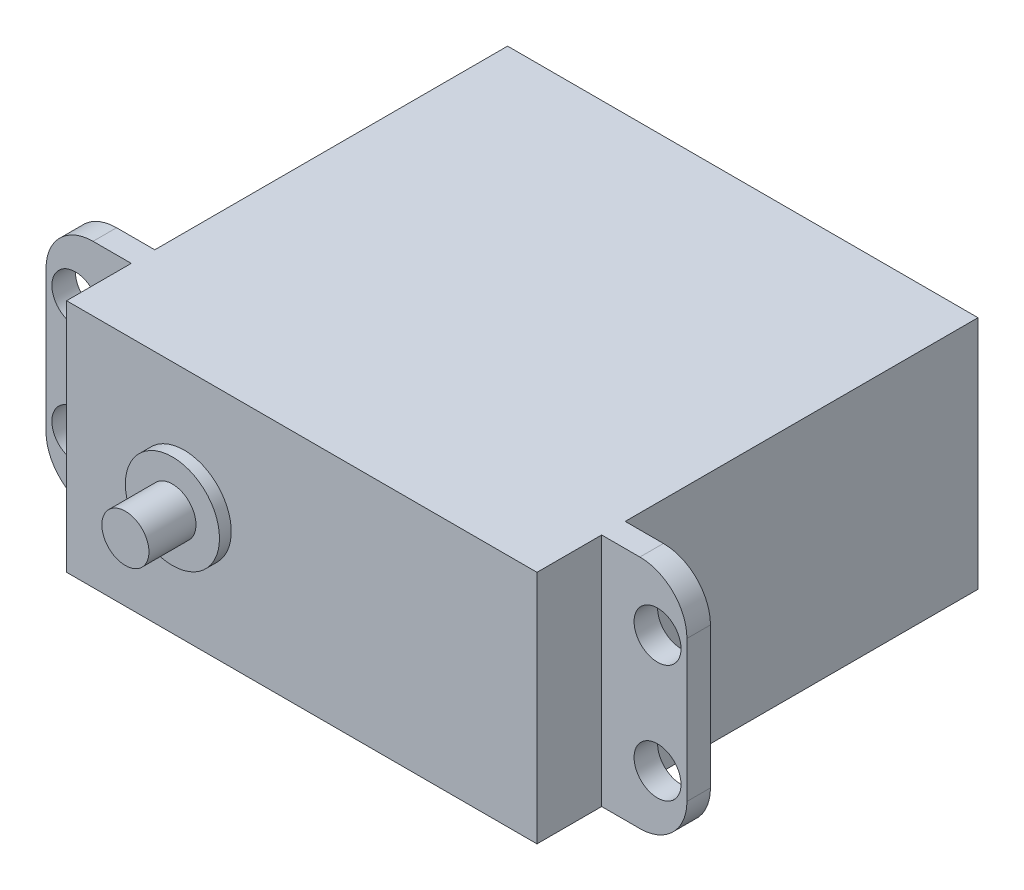
ISO-10303-21;
HEADER;
FILE_DESCRIPTION(('STEP AP214'),'2;1');
FILE_NAME('part.step','',(''),(''),'','','');
FILE_SCHEMA(('AUTOMOTIVE_DESIGN { 1 0 10303 214 1 1 1 1 }'));
ENDSEC;
DATA;
#1=APPLICATION_CONTEXT('core data for automotive mechanical design processes');
#2=APPLICATION_PROTOCOL_DEFINITION('international standard','automotive_design',2000,#1);
#3=PRODUCT_CONTEXT('',#1,'mechanical');
#4=PRODUCT('Part','Part','',(#3));
#5=PRODUCT_RELATED_PRODUCT_CATEGORY('part','',(#4));
#6=PRODUCT_DEFINITION_FORMATION('','',#4);
#7=PRODUCT_DEFINITION_CONTEXT('part definition',#1,'design');
#8=PRODUCT_DEFINITION('design','',#6,#7);
#9=PRODUCT_DEFINITION_SHAPE('','',#8);
#10=(LENGTH_UNIT() NAMED_UNIT(*) SI_UNIT(.MILLI.,.METRE.));
#11=(NAMED_UNIT(*) PLANE_ANGLE_UNIT() SI_UNIT($,.RADIAN.));
#12=(NAMED_UNIT(*) SI_UNIT($,.STERADIAN.) SOLID_ANGLE_UNIT());
#13=UNCERTAINTY_MEASURE_WITH_UNIT(LENGTH_MEASURE(1.E-05),#10,'distance_accuracy_value','');
#14=(GEOMETRIC_REPRESENTATION_CONTEXT(3) GLOBAL_UNCERTAINTY_ASSIGNED_CONTEXT((#13)) GLOBAL_UNIT_ASSIGNED_CONTEXT((#10,
#11,#12)) REPRESENTATION_CONTEXT('',''));
#15=CARTESIAN_POINT('',(0.,0.,0.));
#16=DIRECTION('',(0.,0.,1.));
#17=DIRECTION('',(1.,0.,0.));
#18=AXIS2_PLACEMENT_3D('',#15,#16,#17);
#19=CARTESIAN_POINT('',(-20.,-10.,37.5));
#20=DIRECTION('',(-1.,0.,0.));
#21=DIRECTION('',(0.,0.,1.));
#22=AXIS2_PLACEMENT_3D('',#19,#20,#21);
#23=PLANE('',#22);
#24=DIRECTION('',(0.,-1.,0.));
#25=VECTOR('',#24,1.);
#26=CARTESIAN_POINT('',(-20.,10.,30.));
#27=LINE('',#26,#25);
#28=CARTESIAN_POINT('',(-20.,10.,30.));
#29=VERTEX_POINT('',#28);
#30=CARTESIAN_POINT('',(-20.,-10.,30.));
#31=VERTEX_POINT('',#30);
#32=EDGE_CURVE('E190',#29,#31,#27,.T.);
#33=ORIENTED_EDGE('',*,*,#32,.F.);
#34=DIRECTION('',(0.,0.,-1.));
#35=VECTOR('',#34,1.);
#36=CARTESIAN_POINT('',(-20.,10.,37.5));
#37=LINE('',#36,#35);
#38=CARTESIAN_POINT('',(-20.,10.,0.));
#39=VERTEX_POINT('',#38);
#40=EDGE_CURVE('E185',#29,#39,#37,.T.);
#41=ORIENTED_EDGE('',*,*,#40,.T.);
#42=DIRECTION('',(0.,1.,0.));
#43=VECTOR('',#42,1.);
#44=CARTESIAN_POINT('',(-20.,-10.,0.));
#45=LINE('',#44,#43);
#46=CARTESIAN_POINT('',(-20.,-10.,0.));
#47=VERTEX_POINT('',#46);
#48=EDGE_CURVE('E248',#47,#39,#45,.T.);
#49=ORIENTED_EDGE('',*,*,#48,.F.);
#50=DIRECTION('',(0.,0.,-1.));
#51=VECTOR('',#50,1.);
#52=CARTESIAN_POINT('',(-20.,-10.,37.5));
#53=LINE('',#52,#51);
#54=EDGE_CURVE('E287',#31,#47,#53,.T.);
#55=ORIENTED_EDGE('',*,*,#54,.F.);
#56=EDGE_LOOP('',(#33,#41,#49,#55));
#57=FACE_BOUND('',#56,.T.);
#58=ADVANCED_FACE('F45',(#57),#23,.T.);
#59=CARTESIAN_POINT('',(20.,-10.,37.5));
#60=DIRECTION('',(-1.,0.,0.));
#61=DIRECTION('',(0.,0.,1.));
#62=AXIS2_PLACEMENT_3D('',#59,#60,#61);
#63=PLANE('',#62);
#64=DIRECTION('',(0.,0.,-1.));
#65=VECTOR('',#64,1.);
#66=CARTESIAN_POINT('',(20.,-10.,37.5));
#67=LINE('',#66,#65);
#68=CARTESIAN_POINT('',(20.,-10.,37.5));
#69=VERTEX_POINT('',#68);
#70=CARTESIAN_POINT('',(20.,-10.,32.));
#71=VERTEX_POINT('',#70);
#72=EDGE_CURVE('E288',#69,#71,#67,.T.);
#73=ORIENTED_EDGE('',*,*,#72,.T.);
#74=DIRECTION('',(0.,1.,0.));
#75=VECTOR('',#74,1.);
#76=CARTESIAN_POINT('',(20.,-10.,32.));
#77=LINE('',#76,#75);
#78=CARTESIAN_POINT('',(20.,10.,32.));
#79=VERTEX_POINT('',#78);
#80=EDGE_CURVE('E217',#71,#79,#77,.T.);
#81=ORIENTED_EDGE('',*,*,#80,.T.);
#82=DIRECTION('',(0.,0.,-1.));
#83=VECTOR('',#82,1.);
#84=CARTESIAN_POINT('',(20.,10.,37.5));
#85=LINE('',#84,#83);
#86=CARTESIAN_POINT('',(20.,10.,37.5));
#87=VERTEX_POINT('',#86);
#88=EDGE_CURVE('E293',#87,#79,#85,.T.);
#89=ORIENTED_EDGE('',*,*,#88,.F.);
#90=DIRECTION('',(0.,1.,0.));
#91=VECTOR('',#90,1.);
#92=CARTESIAN_POINT('',(20.,-10.,37.5));
#93=LINE('',#92,#91);
#94=EDGE_CURVE('E263',#69,#87,#93,.T.);
#95=ORIENTED_EDGE('',*,*,#94,.F.);
#96=EDGE_LOOP('',(#73,#81,#89,#95));
#97=FACE_BOUND('',#96,.T.);
#98=ADVANCED_FACE('F361',(#97),#63,.F.);
#99=DIRECTION('',(0.,1.,0.));
#100=VECTOR('',#99,1.);
#101=CARTESIAN_POINT('',(-20.,-10.,32.));
#102=LINE('',#101,#100);
#103=CARTESIAN_POINT('',(-20.,-10.,32.));
#104=VERTEX_POINT('',#103);
#105=CARTESIAN_POINT('',(-20.,10.,32.));
#106=VERTEX_POINT('',#105);
#107=EDGE_CURVE('E179',#104,#106,#102,.T.);
#108=ORIENTED_EDGE('',*,*,#107,.F.);
#109=CARTESIAN_POINT('',(-20.,-10.,37.5));
#110=VERTEX_POINT('',#109);
#111=EDGE_CURVE('E283',#110,#104,#53,.T.);
#112=ORIENTED_EDGE('',*,*,#111,.F.);
#113=DIRECTION('',(0.,1.,0.));
#114=VECTOR('',#113,1.);
#115=CARTESIAN_POINT('',(-20.,-10.,37.5));
#116=LINE('',#115,#114);
#117=CARTESIAN_POINT('',(-20.,10.,37.5));
#118=VERTEX_POINT('',#117);
#119=EDGE_CURVE('E182',#110,#118,#116,.T.);
#120=ORIENTED_EDGE('',*,*,#119,.T.);
#121=EDGE_CURVE('E164',#118,#106,#37,.T.);
#122=ORIENTED_EDGE('',*,*,#121,.T.);
#123=EDGE_LOOP('',(#108,#112,#120,#122));
#124=FACE_BOUND('',#123,.T.);
#125=ADVANCED_FACE('F178',(#124),#23,.T.);
#126=CARTESIAN_POINT('',(-20.,-10.,37.5));
#127=DIRECTION('',(0.,1.,0.));
#128=DIRECTION('',(0.,0.,1.));
#129=AXIS2_PLACEMENT_3D('',#126,#127,#128);
#130=PLANE('',#129);
#131=DIRECTION('',(1.,0.,0.));
#132=VECTOR('',#131,1.);
#133=CARTESIAN_POINT('',(-27.25,-10.,32.));
#134=LINE('',#133,#132);
#135=CARTESIAN_POINT('',(-23.25,-10.,32.));
#136=VERTEX_POINT('',#135);
#137=EDGE_CURVE('E172',#136,#104,#134,.T.);
#138=ORIENTED_EDGE('',*,*,#137,.F.);
#139=DIRECTION('',(0.,0.,1.));
#140=VECTOR('',#139,1.);
#141=CARTESIAN_POINT('',(-23.25,-10.,30.));
#142=LINE('',#141,#140);
#143=CARTESIAN_POINT('',(-23.25,-10.,30.));
#144=VERTEX_POINT('',#143);
#145=EDGE_CURVE('E70',#136,#144,#142,.F.);
#146=ORIENTED_EDGE('',*,*,#145,.T.);
#147=DIRECTION('',(1.,0.,0.));
#148=VECTOR('',#147,1.);
#149=CARTESIAN_POINT('',(-27.25,-10.,30.));
#150=LINE('',#149,#148);
#151=EDGE_CURVE('E205',#144,#31,#150,.T.);
#152=ORIENTED_EDGE('',*,*,#151,.T.);
#153=ORIENTED_EDGE('',*,*,#54,.T.);
#154=DIRECTION('',(1.,0.,0.));
#155=VECTOR('',#154,1.);
#156=CARTESIAN_POINT('',(-20.,-10.,0.));
#157=LINE('',#156,#155);
#158=CARTESIAN_POINT('',(20.,-10.,0.));
#159=VERTEX_POINT('',#158);
#160=EDGE_CURVE('E260',#47,#159,#157,.T.);
#161=ORIENTED_EDGE('',*,*,#160,.T.);
#162=CARTESIAN_POINT('',(20.,-10.,30.));
#163=VERTEX_POINT('',#162);
#164=EDGE_CURVE('E292',#163,#159,#67,.T.);
#165=ORIENTED_EDGE('',*,*,#164,.F.);
#166=DIRECTION('',(-1.,0.,0.));
#167=VECTOR('',#166,1.);
#168=CARTESIAN_POINT('',(27.25,-10.,30.));
#169=LINE('',#168,#167);
#170=CARTESIAN_POINT('',(23.25,-10.,30.));
#171=VERTEX_POINT('',#170);
#172=EDGE_CURVE('E245',#171,#163,#169,.T.);
#173=ORIENTED_EDGE('',*,*,#172,.F.);
#174=DIRECTION('',(0.,0.,1.));
#175=VECTOR('',#174,1.);
#176=CARTESIAN_POINT('',(23.25,-10.,37.5));
#177=LINE('',#176,#175);
#178=CARTESIAN_POINT('',(23.25,-10.,32.));
#179=VERTEX_POINT('',#178);
#180=EDGE_CURVE('E318',#171,#179,#177,.T.);
#181=ORIENTED_EDGE('',*,*,#180,.T.);
#182=DIRECTION('',(-1.,0.,0.));
#183=VECTOR('',#182,1.);
#184=CARTESIAN_POINT('',(27.25,-10.,32.));
#185=LINE('',#184,#183);
#186=EDGE_CURVE('E238',#179,#71,#185,.T.);
#187=ORIENTED_EDGE('',*,*,#186,.T.);
#188=ORIENTED_EDGE('',*,*,#72,.F.);
#189=DIRECTION('',(1.,0.,0.));
#190=VECTOR('',#189,1.);
#191=CARTESIAN_POINT('',(-20.,-10.,37.5));
#192=LINE('',#191,#190);
#193=EDGE_CURVE('E266',#110,#69,#192,.T.);
#194=ORIENTED_EDGE('',*,*,#193,.F.);
#195=ORIENTED_EDGE('',*,*,#111,.T.);
#196=EDGE_LOOP('',(#138,#146,#152,#153,#161,#165,#173,#181,#187,#188,#194,#195));
#197=FACE_BOUND('',#196,.T.);
#198=ADVANCED_FACE('F447',(#197),#130,.F.);
#199=CARTESIAN_POINT('',(20.,10.,30.));
#200=VERTEX_POINT('',#199);
#201=CARTESIAN_POINT('',(20.,10.,0.));
#202=VERTEX_POINT('',#201);
#203=EDGE_CURVE('E184',#200,#202,#85,.T.);
#204=ORIENTED_EDGE('',*,*,#203,.F.);
#205=DIRECTION('',(0.,-1.,0.));
#206=VECTOR('',#205,1.);
#207=CARTESIAN_POINT('',(20.,10.,30.));
#208=LINE('',#207,#206);
#209=EDGE_CURVE('E234',#200,#163,#208,.T.);
#210=ORIENTED_EDGE('',*,*,#209,.T.);
#211=ORIENTED_EDGE('',*,*,#164,.T.);
#212=DIRECTION('',(0.,1.,0.));
#213=VECTOR('',#212,1.);
#214=CARTESIAN_POINT('',(20.,-10.,0.));
#215=LINE('',#214,#213);
#216=EDGE_CURVE('E276',#159,#202,#215,.T.);
#217=ORIENTED_EDGE('',*,*,#216,.T.);
#218=EDGE_LOOP('',(#204,#210,#211,#217));
#219=FACE_BOUND('',#218,.T.);
#220=ADVANCED_FACE('F380',(#219),#63,.F.);
#221=CARTESIAN_POINT('',(-20.,10.,37.5));
#222=DIRECTION('',(0.,1.,0.));
#223=DIRECTION('',(0.,0.,1.));
#224=AXIS2_PLACEMENT_3D('',#221,#222,#223);
#225=PLANE('',#224);
#226=DIRECTION('',(1.,0.,0.));
#227=VECTOR('',#226,1.);
#228=CARTESIAN_POINT('',(-27.25,10.,30.));
#229=LINE('',#228,#227);
#230=CARTESIAN_POINT('',(-23.25,10.,30.));
#231=VERTEX_POINT('',#230);
#232=EDGE_CURVE('E173',#231,#29,#229,.T.);
#233=ORIENTED_EDGE('',*,*,#232,.F.);
#234=DIRECTION('',(0.,0.,-1.));
#235=VECTOR('',#234,1.);
#236=CARTESIAN_POINT('',(-23.25,10.,37.5));
#237=LINE('',#236,#235);
#238=CARTESIAN_POINT('',(-23.25,10.,32.));
#239=VERTEX_POINT('',#238);
#240=EDGE_CURVE('E167',#231,#239,#237,.F.);
#241=ORIENTED_EDGE('',*,*,#240,.T.);
#242=DIRECTION('',(1.,0.,0.));
#243=VECTOR('',#242,1.);
#244=CARTESIAN_POINT('',(-27.25,10.,32.));
#245=LINE('',#244,#243);
#246=EDGE_CURVE('E160',#239,#106,#245,.T.);
#247=ORIENTED_EDGE('',*,*,#246,.T.);
#248=ORIENTED_EDGE('',*,*,#121,.F.);
#249=DIRECTION('',(1.,0.,0.));
#250=VECTOR('',#249,1.);
#251=CARTESIAN_POINT('',(-20.,10.,37.5));
#252=LINE('',#251,#250);
#253=EDGE_CURVE('E259',#118,#87,#252,.T.);
#254=ORIENTED_EDGE('',*,*,#253,.T.);
#255=ORIENTED_EDGE('',*,*,#88,.T.);
#256=DIRECTION('',(-1.,0.,0.));
#257=VECTOR('',#256,1.);
#258=CARTESIAN_POINT('',(27.25,10.,32.));
#259=LINE('',#258,#257);
#260=CARTESIAN_POINT('',(23.25,10.,32.));
#261=VERTEX_POINT('',#260);
#262=EDGE_CURVE('E252',#261,#79,#259,.T.);
#263=ORIENTED_EDGE('',*,*,#262,.F.);
#264=DIRECTION('',(0.,0.,-1.));
#265=VECTOR('',#264,1.);
#266=CARTESIAN_POINT('',(23.25,10.,30.));
#267=LINE('',#266,#265);
#268=CARTESIAN_POINT('',(23.25,10.,30.));
#269=VERTEX_POINT('',#268);
#270=EDGE_CURVE('E286',#261,#269,#267,.T.);
#271=ORIENTED_EDGE('',*,*,#270,.T.);
#272=DIRECTION('',(-1.,0.,0.));
#273=VECTOR('',#272,1.);
#274=CARTESIAN_POINT('',(27.25,10.,30.));
#275=LINE('',#274,#273);
#276=EDGE_CURVE('E249',#269,#200,#275,.T.);
#277=ORIENTED_EDGE('',*,*,#276,.T.);
#278=ORIENTED_EDGE('',*,*,#203,.T.);
#279=DIRECTION('',(1.,0.,0.));
#280=VECTOR('',#279,1.);
#281=CARTESIAN_POINT('',(-20.,10.,0.));
#282=LINE('',#281,#280);
#283=EDGE_CURVE('E272',#39,#202,#282,.T.);
#284=ORIENTED_EDGE('',*,*,#283,.F.);
#285=ORIENTED_EDGE('',*,*,#40,.F.);
#286=EDGE_LOOP('',(#233,#241,#247,#248,#254,#255,#263,#271,#277,#278,#284,#285));
#287=FACE_BOUND('',#286,.T.);
#288=ADVANCED_FACE('F162',(#287),#225,.T.);
#289=CARTESIAN_POINT('',(0.,0.,37.5));
#290=DIRECTION('',(0.,0.,-1.));
#291=DIRECTION('',(-1.,0.,0.));
#292=AXIS2_PLACEMENT_3D('',#289,#290,#291);
#293=PLANE('',#292);
#294=CARTESIAN_POINT('',(-10.,0.,37.5));
#295=DIRECTION('',(0.,0.,-1.));
#296=DIRECTION('',(-1.,0.,0.));
#297=AXIS2_PLACEMENT_3D('',#294,#295,#296);
#298=CIRCLE('',#297,4.00126321655087);
#299=CARTESIAN_POINT('',(-14.0012632165509,0.,37.5));
#300=VERTEX_POINT('',#299);
#301=EDGE_CURVE('E49',#300,#300,#298,.F.);
#302=ORIENTED_EDGE('',*,*,#301,.F.);
#303=EDGE_LOOP('',(#302));
#304=FACE_BOUND('',#303,.T.);
#305=ORIENTED_EDGE('',*,*,#119,.F.);
#306=ORIENTED_EDGE('',*,*,#193,.T.);
#307=ORIENTED_EDGE('',*,*,#94,.T.);
#308=ORIENTED_EDGE('',*,*,#253,.F.);
#309=EDGE_LOOP('',(#305,#306,#307,#308));
#310=FACE_BOUND('',#309,.T.);
#311=ADVANCED_FACE('F349',(#304,#310),#293,.F.);
#312=CARTESIAN_POINT('',(0.,0.,0.));
#313=DIRECTION('',(0.,0.,-1.));
#314=DIRECTION('',(-1.,0.,0.));
#315=AXIS2_PLACEMENT_3D('',#312,#313,#314);
#316=PLANE('',#315);
#317=ORIENTED_EDGE('',*,*,#48,.T.);
#318=ORIENTED_EDGE('',*,*,#283,.T.);
#319=ORIENTED_EDGE('',*,*,#216,.F.);
#320=ORIENTED_EDGE('',*,*,#160,.F.);
#321=EDGE_LOOP('',(#317,#318,#319,#320));
#322=FACE_BOUND('',#321,.T.);
#323=ADVANCED_FACE('F352',(#322),#316,.T.);
#324=CARTESIAN_POINT('',(27.25,10.,30.));
#325=DIRECTION('',(0.,0.,-1.));
#326=DIRECTION('',(0.,1.,0.));
#327=AXIS2_PLACEMENT_3D('',#324,#325,#326);
#328=PLANE('',#327);
#329=CARTESIAN_POINT('',(24.75,4.99942998703595,30.));
#330=DIRECTION('',(0.,0.,1.));
#331=DIRECTION('',(1.,0.,0.));
#332=AXIS2_PLACEMENT_3D('',#329,#330,#331);
#333=CIRCLE('',#332,1.99547319519888);
#334=CARTESIAN_POINT('',(26.7454731951989,4.99942998703595,30.));
#335=VERTEX_POINT('',#334);
#336=EDGE_CURVE('E213',#335,#335,#333,.T.);
#337=ORIENTED_EDGE('',*,*,#336,.T.);
#338=EDGE_LOOP('',(#337));
#339=FACE_BOUND('',#338,.T.);
#340=CARTESIAN_POINT('',(24.75,-4.99913934048573,30.));
#341=DIRECTION('',(0.,0.,1.));
#342=DIRECTION('',(1.,0.,0.));
#343=AXIS2_PLACEMENT_3D('',#340,#341,#342);
#344=CIRCLE('',#343,1.99547319519888);
#345=CARTESIAN_POINT('',(26.7454731951989,-4.99913934048573,30.));
#346=VERTEX_POINT('',#345);
#347=EDGE_CURVE('E212',#346,#346,#344,.T.);
#348=ORIENTED_EDGE('',*,*,#347,.T.);
#349=EDGE_LOOP('',(#348));
#350=FACE_BOUND('',#349,.T.);
#351=ORIENTED_EDGE('',*,*,#276,.F.);
#352=CARTESIAN_POINT('',(23.25,6.,30.));
#353=DIRECTION('',(0.,0.,-1.));
#354=DIRECTION('',(0.,1.,0.));
#355=AXIS2_PLACEMENT_3D('',#352,#353,#354);
#356=CIRCLE('',#355,4.);
#357=CARTESIAN_POINT('',(27.25,6.,30.));
#358=VERTEX_POINT('',#357);
#359=EDGE_CURVE('E303',#269,#358,#356,.T.);
#360=ORIENTED_EDGE('',*,*,#359,.T.);
#361=DIRECTION('',(0.,-1.,0.));
#362=VECTOR('',#361,1.);
#363=CARTESIAN_POINT('',(27.25,10.,30.));
#364=LINE('',#363,#362);
#365=CARTESIAN_POINT('',(27.25,-6.,30.));
#366=VERTEX_POINT('',#365);
#367=EDGE_CURVE('E233',#358,#366,#364,.T.);
#368=ORIENTED_EDGE('',*,*,#367,.T.);
#369=CARTESIAN_POINT('',(23.25,-6.,30.));
#370=DIRECTION('',(0.,0.,-1.));
#371=DIRECTION('',(0.,1.,0.));
#372=AXIS2_PLACEMENT_3D('',#369,#370,#371);
#373=CIRCLE('',#372,4.);
#374=EDGE_CURVE('E300',#366,#171,#373,.T.);
#375=ORIENTED_EDGE('',*,*,#374,.T.);
#376=ORIENTED_EDGE('',*,*,#172,.T.);
#377=ORIENTED_EDGE('',*,*,#209,.F.);
#378=EDGE_LOOP('',(#351,#360,#368,#375,#376,#377));
#379=FACE_BOUND('',#378,.T.);
#380=ADVANCED_FACE('F374',(#339,#350,#379),#328,.T.);
#381=CARTESIAN_POINT('',(27.25,-10.,32.));
#382=DIRECTION('',(0.,0.,1.));
#383=DIRECTION('',(1.,0.,0.));
#384=AXIS2_PLACEMENT_3D('',#381,#382,#383);
#385=PLANE('',#384);
#386=CARTESIAN_POINT('',(24.75,4.99942998703595,32.));
#387=DIRECTION('',(0.,0.,1.));
#388=DIRECTION('',(1.,0.,0.));
#389=AXIS2_PLACEMENT_3D('',#386,#387,#388);
#390=CIRCLE('',#389,1.99547319519888);
#391=CARTESIAN_POINT('',(26.7454731951989,4.99942998703595,32.));
#392=VERTEX_POINT('',#391);
#393=EDGE_CURVE('E218',#392,#392,#390,.T.);
#394=ORIENTED_EDGE('',*,*,#393,.F.);
#395=EDGE_LOOP('',(#394));
#396=FACE_BOUND('',#395,.T.);
#397=CARTESIAN_POINT('',(24.75,-4.99913934048573,32.));
#398=DIRECTION('',(0.,0.,1.));
#399=DIRECTION('',(1.,0.,0.));
#400=AXIS2_PLACEMENT_3D('',#397,#398,#399);
#401=CIRCLE('',#400,1.99547319519888);
#402=CARTESIAN_POINT('',(26.7454731951989,-4.99913934048573,32.));
#403=VERTEX_POINT('',#402);
#404=EDGE_CURVE('E222',#403,#403,#401,.T.);
#405=ORIENTED_EDGE('',*,*,#404,.F.);
#406=EDGE_LOOP('',(#405));
#407=FACE_BOUND('',#406,.T.);
#408=DIRECTION('',(0.,1.,0.));
#409=VECTOR('',#408,1.);
#410=CARTESIAN_POINT('',(27.25,-10.,32.));
#411=LINE('',#410,#409);
#412=CARTESIAN_POINT('',(27.25,-6.,32.));
#413=VERTEX_POINT('',#412);
#414=CARTESIAN_POINT('',(27.25,6.,32.));
#415=VERTEX_POINT('',#414);
#416=EDGE_CURVE('E229',#413,#415,#411,.T.);
#417=ORIENTED_EDGE('',*,*,#416,.T.);
#418=CARTESIAN_POINT('',(23.25,6.,32.));
#419=DIRECTION('',(0.,0.,1.));
#420=DIRECTION('',(1.,0.,0.));
#421=AXIS2_PLACEMENT_3D('',#418,#419,#420);
#422=CIRCLE('',#421,4.);
#423=EDGE_CURVE('E315',#415,#261,#422,.T.);
#424=ORIENTED_EDGE('',*,*,#423,.T.);
#425=ORIENTED_EDGE('',*,*,#262,.T.);
#426=ORIENTED_EDGE('',*,*,#80,.F.);
#427=ORIENTED_EDGE('',*,*,#186,.F.);
#428=CARTESIAN_POINT('',(23.25,-6.,32.));
#429=DIRECTION('',(0.,0.,1.));
#430=DIRECTION('',(1.,0.,0.));
#431=AXIS2_PLACEMENT_3D('',#428,#429,#430);
#432=CIRCLE('',#431,4.);
#433=EDGE_CURVE('E312',#179,#413,#432,.T.);
#434=ORIENTED_EDGE('',*,*,#433,.T.);
#435=EDGE_LOOP('',(#417,#424,#425,#426,#427,#434));
#436=FACE_BOUND('',#435,.T.);
#437=ADVANCED_FACE('F365',(#396,#407,#436),#385,.T.);
#438=CARTESIAN_POINT('',(27.25,0.,0.));
#439=DIRECTION('',(-1.,0.,0.));
#440=DIRECTION('',(0.,0.,1.));
#441=AXIS2_PLACEMENT_3D('',#438,#439,#440);
#442=PLANE('',#441);
#443=ORIENTED_EDGE('',*,*,#367,.F.);
#444=DIRECTION('',(0.,0.,-1.));
#445=VECTOR('',#444,1.);
#446=CARTESIAN_POINT('',(27.25,6.,32.));
#447=LINE('',#446,#445);
#448=EDGE_CURVE('E309',#358,#415,#447,.F.);
#449=ORIENTED_EDGE('',*,*,#448,.T.);
#450=ORIENTED_EDGE('',*,*,#416,.F.);
#451=DIRECTION('',(0.,0.,1.));
#452=VECTOR('',#451,1.);
#453=CARTESIAN_POINT('',(27.25,-6.,0.));
#454=LINE('',#453,#452);
#455=EDGE_CURVE('E306',#413,#366,#454,.F.);
#456=ORIENTED_EDGE('',*,*,#455,.T.);
#457=EDGE_LOOP('',(#443,#449,#450,#456));
#458=FACE_BOUND('',#457,.T.);
#459=ADVANCED_FACE('F558',(#458),#442,.F.);
#460=CARTESIAN_POINT('',(24.75,-4.99913934048573,30.));
#461=DIRECTION('',(0.,0.,1.));
#462=DIRECTION('',(1.,0.,0.));
#463=AXIS2_PLACEMENT_3D('',#460,#461,#462);
#464=CYLINDRICAL_SURFACE('',#463,1.99547319519888);
#465=ORIENTED_EDGE('',*,*,#347,.F.);
#466=EDGE_LOOP('',(#465));
#467=FACE_BOUND('',#466,.T.);
#468=ORIENTED_EDGE('',*,*,#404,.T.);
#469=EDGE_LOOP('',(#468));
#470=FACE_BOUND('',#469,.T.);
#471=ADVANCED_FACE('F568',(#467,#470),#464,.F.);
#472=CARTESIAN_POINT('',(24.75,4.99942998703595,30.));
#473=DIRECTION('',(0.,0.,1.));
#474=DIRECTION('',(1.,0.,0.));
#475=AXIS2_PLACEMENT_3D('',#472,#473,#474);
#476=CYLINDRICAL_SURFACE('',#475,1.99547319519888);
#477=ORIENTED_EDGE('',*,*,#336,.F.);
#478=EDGE_LOOP('',(#477));
#479=FACE_BOUND('',#478,.T.);
#480=ORIENTED_EDGE('',*,*,#393,.T.);
#481=EDGE_LOOP('',(#480));
#482=FACE_BOUND('',#481,.T.);
#483=ADVANCED_FACE('F579',(#479,#482),#476,.F.);
#484=CARTESIAN_POINT('',(23.25,6.,37.5));
#485=DIRECTION('',(0.,0.,1.));
#486=DIRECTION('',(1.,0.,0.));
#487=AXIS2_PLACEMENT_3D('',#484,#485,#486);
#488=CYLINDRICAL_SURFACE('',#487,4.);
#489=ORIENTED_EDGE('',*,*,#423,.F.);
#490=ORIENTED_EDGE('',*,*,#448,.F.);
#491=ORIENTED_EDGE('',*,*,#359,.F.);
#492=ORIENTED_EDGE('',*,*,#270,.F.);
#493=EDGE_LOOP('',(#489,#490,#491,#492));
#494=FACE_BOUND('',#493,.T.);
#495=ADVANCED_FACE('F370',(#494),#488,.T.);
#496=CARTESIAN_POINT('',(23.25,-6.,37.5));
#497=DIRECTION('',(0.,0.,1.));
#498=DIRECTION('',(1.,0.,0.));
#499=AXIS2_PLACEMENT_3D('',#496,#497,#498);
#500=CYLINDRICAL_SURFACE('',#499,4.);
#501=ORIENTED_EDGE('',*,*,#374,.F.);
#502=ORIENTED_EDGE('',*,*,#455,.F.);
#503=ORIENTED_EDGE('',*,*,#433,.F.);
#504=ORIENTED_EDGE('',*,*,#180,.F.);
#505=EDGE_LOOP('',(#501,#502,#503,#504));
#506=FACE_BOUND('',#505,.T.);
#507=ADVANCED_FACE('F469',(#506),#500,.T.);
#508=CARTESIAN_POINT('',(-27.25,-10.,32.));
#509=DIRECTION('',(0.,0.,-1.));
#510=DIRECTION('',(-1.,0.,0.));
#511=AXIS2_PLACEMENT_3D('',#508,#509,#510);
#512=PLANE('',#511);
#513=CARTESIAN_POINT('',(-24.75,5.,32.));
#514=DIRECTION('',(0.,0.,1.));
#515=DIRECTION('',(1.,0.,0.));
#516=AXIS2_PLACEMENT_3D('',#513,#514,#515);
#517=CIRCLE('',#516,2.);
#518=CARTESIAN_POINT('',(-22.75,5.,32.));
#519=VERTEX_POINT('',#518);
#520=EDGE_CURVE('E199',#519,#519,#517,.T.);
#521=ORIENTED_EDGE('',*,*,#520,.F.);
#522=EDGE_LOOP('',(#521));
#523=FACE_BOUND('',#522,.T.);
#524=CARTESIAN_POINT('',(-24.75,-5.,32.));
#525=DIRECTION('',(0.,0.,1.));
#526=DIRECTION('',(1.,0.,0.));
#527=AXIS2_PLACEMENT_3D('',#524,#525,#526);
#528=CIRCLE('',#527,2.);
#529=CARTESIAN_POINT('',(-22.75,-5.,32.));
#530=VERTEX_POINT('',#529);
#531=EDGE_CURVE('E397',#530,#530,#528,.T.);
#532=ORIENTED_EDGE('',*,*,#531,.F.);
#533=EDGE_LOOP('',(#532));
#534=FACE_BOUND('',#533,.T.);
#535=DIRECTION('',(0.,1.,0.));
#536=VECTOR('',#535,1.);
#537=CARTESIAN_POINT('',(-27.25,-10.,32.));
#538=LINE('',#537,#536);
#539=CARTESIAN_POINT('',(-27.25,-6.,32.));
#540=VERTEX_POINT('',#539);
#541=CARTESIAN_POINT('',(-27.25,6.,32.));
#542=VERTEX_POINT('',#541);
#543=EDGE_CURVE('E196',#540,#542,#538,.T.);
#544=ORIENTED_EDGE('',*,*,#543,.F.);
#545=CARTESIAN_POINT('',(-23.25,-6.,32.));
#546=DIRECTION('',(0.,0.,-1.));
#547=DIRECTION('',(-1.,0.,0.));
#548=AXIS2_PLACEMENT_3D('',#545,#546,#547);
#549=CIRCLE('',#548,4.);
#550=EDGE_CURVE('E333',#540,#136,#549,.F.);
#551=ORIENTED_EDGE('',*,*,#550,.T.);
#552=ORIENTED_EDGE('',*,*,#137,.T.);
#553=ORIENTED_EDGE('',*,*,#107,.T.);
#554=ORIENTED_EDGE('',*,*,#246,.F.);
#555=CARTESIAN_POINT('',(-23.25,6.,32.));
#556=DIRECTION('',(0.,0.,-1.));
#557=DIRECTION('',(-1.,0.,0.));
#558=AXIS2_PLACEMENT_3D('',#555,#556,#557);
#559=CIRCLE('',#558,4.);
#560=EDGE_CURVE('E330',#239,#542,#559,.F.);
#561=ORIENTED_EDGE('',*,*,#560,.T.);
#562=EDGE_LOOP('',(#544,#551,#552,#553,#554,#561));
#563=FACE_BOUND('',#562,.T.);
#564=ADVANCED_FACE('F188',(#523,#534,#563),#512,.F.);
#565=CARTESIAN_POINT('',(-27.25,10.,30.));
#566=DIRECTION('',(0.,0.,1.));
#567=DIRECTION('',(0.,-1.,0.));
#568=AXIS2_PLACEMENT_3D('',#565,#566,#567);
#569=PLANE('',#568);
#570=CARTESIAN_POINT('',(-24.75,5.,30.));
#571=DIRECTION('',(0.,0.,1.));
#572=DIRECTION('',(1.,0.,0.));
#573=AXIS2_PLACEMENT_3D('',#570,#571,#572);
#574=CIRCLE('',#573,2.);
#575=CARTESIAN_POINT('',(-22.75,5.,30.));
#576=VERTEX_POINT('',#575);
#577=EDGE_CURVE('E191',#576,#576,#574,.T.);
#578=ORIENTED_EDGE('',*,*,#577,.T.);
#579=EDGE_LOOP('',(#578));
#580=FACE_BOUND('',#579,.T.);
#581=CARTESIAN_POINT('',(-24.75,-5.,30.));
#582=DIRECTION('',(0.,0.,1.));
#583=DIRECTION('',(1.,0.,0.));
#584=AXIS2_PLACEMENT_3D('',#581,#582,#583);
#585=CIRCLE('',#584,2.);
#586=CARTESIAN_POINT('',(-22.75,-5.,30.));
#587=VERTEX_POINT('',#586);
#588=EDGE_CURVE('E393',#587,#587,#585,.T.);
#589=ORIENTED_EDGE('',*,*,#588,.T.);
#590=EDGE_LOOP('',(#589));
#591=FACE_BOUND('',#590,.T.);
#592=ORIENTED_EDGE('',*,*,#151,.F.);
#593=CARTESIAN_POINT('',(-23.25,-6.,30.));
#594=DIRECTION('',(0.,0.,1.));
#595=DIRECTION('',(0.,-1.,0.));
#596=AXIS2_PLACEMENT_3D('',#593,#594,#595);
#597=CIRCLE('',#596,4.);
#598=CARTESIAN_POINT('',(-27.25,-6.,30.));
#599=VERTEX_POINT('',#598);
#600=EDGE_CURVE('E340',#144,#599,#597,.F.);
#601=ORIENTED_EDGE('',*,*,#600,.T.);
#602=DIRECTION('',(0.,-1.,0.));
#603=VECTOR('',#602,1.);
#604=CARTESIAN_POINT('',(-27.25,10.,30.));
#605=LINE('',#604,#603);
#606=CARTESIAN_POINT('',(-27.25,6.,30.));
#607=VERTEX_POINT('',#606);
#608=EDGE_CURVE('E202',#607,#599,#605,.T.);
#609=ORIENTED_EDGE('',*,*,#608,.F.);
#610=CARTESIAN_POINT('',(-23.25,6.,30.));
#611=DIRECTION('',(0.,0.,1.));
#612=DIRECTION('',(0.,-1.,0.));
#613=AXIS2_PLACEMENT_3D('',#610,#611,#612);
#614=CIRCLE('',#613,4.);
#615=EDGE_CURVE('E62',#607,#231,#614,.F.);
#616=ORIENTED_EDGE('',*,*,#615,.T.);
#617=ORIENTED_EDGE('',*,*,#232,.T.);
#618=ORIENTED_EDGE('',*,*,#32,.T.);
#619=EDGE_LOOP('',(#592,#601,#609,#616,#617,#618));
#620=FACE_BOUND('',#619,.T.);
#621=ADVANCED_FACE('F468',(#580,#591,#620),#569,.F.);
#622=CARTESIAN_POINT('',(-27.25,0.,0.));
#623=DIRECTION('',(-1.,0.,0.));
#624=DIRECTION('',(0.,0.,1.));
#625=AXIS2_PLACEMENT_3D('',#622,#623,#624);
#626=PLANE('',#625);
#627=ORIENTED_EDGE('',*,*,#608,.T.);
#628=DIRECTION('',(0.,0.,1.));
#629=VECTOR('',#628,1.);
#630=CARTESIAN_POINT('',(-27.25,-6.,32.));
#631=LINE('',#630,#629);
#632=EDGE_CURVE('E326',#599,#540,#631,.T.);
#633=ORIENTED_EDGE('',*,*,#632,.T.);
#634=ORIENTED_EDGE('',*,*,#543,.T.);
#635=DIRECTION('',(0.,0.,-1.));
#636=VECTOR('',#635,1.);
#637=CARTESIAN_POINT('',(-27.25,6.,0.));
#638=LINE('',#637,#636);
#639=EDGE_CURVE('E322',#542,#607,#638,.T.);
#640=ORIENTED_EDGE('',*,*,#639,.T.);
#641=EDGE_LOOP('',(#627,#633,#634,#640));
#642=FACE_BOUND('',#641,.T.);
#643=ADVANCED_FACE('F478',(#642),#626,.T.);
#644=CARTESIAN_POINT('',(-24.75,-5.,30.));
#645=DIRECTION('',(0.,0.,1.));
#646=DIRECTION('',(1.,0.,0.));
#647=AXIS2_PLACEMENT_3D('',#644,#645,#646);
#648=CYLINDRICAL_SURFACE('',#647,2.);
#649=ORIENTED_EDGE('',*,*,#588,.F.);
#650=EDGE_LOOP('',(#649));
#651=FACE_BOUND('',#650,.T.);
#652=ORIENTED_EDGE('',*,*,#531,.T.);
#653=EDGE_LOOP('',(#652));
#654=FACE_BOUND('',#653,.T.);
#655=ADVANCED_FACE('F487',(#651,#654),#648,.F.);
#656=CARTESIAN_POINT('',(-24.75,5.,30.));
#657=DIRECTION('',(0.,0.,1.));
#658=DIRECTION('',(1.,0.,0.));
#659=AXIS2_PLACEMENT_3D('',#656,#657,#658);
#660=CYLINDRICAL_SURFACE('',#659,2.);
#661=ORIENTED_EDGE('',*,*,#577,.F.);
#662=EDGE_LOOP('',(#661));
#663=FACE_BOUND('',#662,.T.);
#664=ORIENTED_EDGE('',*,*,#520,.T.);
#665=EDGE_LOOP('',(#664));
#666=FACE_BOUND('',#665,.T.);
#667=ADVANCED_FACE('F495',(#663,#666),#660,.F.);
#668=CARTESIAN_POINT('',(-23.25,-6.,0.));
#669=DIRECTION('',(0.,0.,-1.));
#670=DIRECTION('',(-1.,0.,0.));
#671=AXIS2_PLACEMENT_3D('',#668,#669,#670);
#672=CYLINDRICAL_SURFACE('',#671,4.);
#673=ORIENTED_EDGE('',*,*,#600,.F.);
#674=ORIENTED_EDGE('',*,*,#145,.F.);
#675=ORIENTED_EDGE('',*,*,#550,.F.);
#676=ORIENTED_EDGE('',*,*,#632,.F.);
#677=EDGE_LOOP('',(#673,#674,#675,#676));
#678=FACE_BOUND('',#677,.T.);
#679=ADVANCED_FACE('F432',(#678),#672,.T.);
#680=CARTESIAN_POINT('',(-23.25,6.,0.));
#681=DIRECTION('',(0.,0.,-1.));
#682=DIRECTION('',(-1.,0.,0.));
#683=AXIS2_PLACEMENT_3D('',#680,#681,#682);
#684=CYLINDRICAL_SURFACE('',#683,4.);
#685=ORIENTED_EDGE('',*,*,#560,.F.);
#686=ORIENTED_EDGE('',*,*,#240,.F.);
#687=ORIENTED_EDGE('',*,*,#615,.F.);
#688=ORIENTED_EDGE('',*,*,#639,.F.);
#689=EDGE_LOOP('',(#685,#686,#687,#688));
#690=FACE_BOUND('',#689,.T.);
#691=ADVANCED_FACE('F47',(#690),#684,.T.);
#692=CARTESIAN_POINT('',(-10.,0.,38.5));
#693=DIRECTION('',(0.,0.,-1.));
#694=DIRECTION('',(-1.,0.,0.));
#695=AXIS2_PLACEMENT_3D('',#692,#693,#694);
#696=CYLINDRICAL_SURFACE('',#695,4.00126321655087);
#697=CARTESIAN_POINT('',(-10.,0.,38.5));
#698=DIRECTION('',(0.,0.,1.));
#699=DIRECTION('',(1.,0.,0.));
#700=AXIS2_PLACEMENT_3D('',#697,#698,#699);
#701=CIRCLE('',#700,4.00126321655087);
#702=CARTESIAN_POINT('',(-5.99873678344913,0.,38.5));
#703=VERTEX_POINT('',#702);
#704=EDGE_CURVE('E398',#703,#703,#701,.T.);
#705=ORIENTED_EDGE('',*,*,#704,.F.);
#706=EDGE_LOOP('',(#705));
#707=FACE_BOUND('',#706,.T.);
#708=ORIENTED_EDGE('',*,*,#301,.T.);
#709=EDGE_LOOP('',(#708));
#710=FACE_BOUND('',#709,.T.);
#711=ADVANCED_FACE('F347',(#707,#710),#696,.T.);
#712=CARTESIAN_POINT('',(-10.,0.,38.5));
#713=DIRECTION('',(0.,0.,1.));
#714=DIRECTION('',(1.,0.,0.));
#715=AXIS2_PLACEMENT_3D('',#712,#713,#714);
#716=PLANE('',#715);
#717=CARTESIAN_POINT('',(-10.,0.,38.5));
#718=DIRECTION('',(0.,0.,1.));
#719=DIRECTION('',(1.,0.,0.));
#720=AXIS2_PLACEMENT_3D('',#717,#718,#719);
#721=CIRCLE('',#720,2.00146196295762);
#722=CARTESIAN_POINT('',(-7.99853803704238,0.,38.5));
#723=VERTEX_POINT('',#722);
#724=EDGE_CURVE('E11',#723,#723,#721,.T.);
#725=ORIENTED_EDGE('',*,*,#724,.F.);
#726=EDGE_LOOP('',(#725));
#727=FACE_BOUND('',#726,.T.);
#728=ORIENTED_EDGE('',*,*,#704,.T.);
#729=EDGE_LOOP('',(#728));
#730=FACE_BOUND('',#729,.T.);
#731=ADVANCED_FACE('F418',(#727,#730),#716,.T.);
#732=CARTESIAN_POINT('',(-10.,0.,42.5));
#733=DIRECTION('',(0.,0.,-1.));
#734=DIRECTION('',(-1.,0.,0.));
#735=AXIS2_PLACEMENT_3D('',#732,#733,#734);
#736=CYLINDRICAL_SURFACE('',#735,2.00146196295762);
#737=CARTESIAN_POINT('',(-10.,0.,42.5));
#738=DIRECTION('',(0.,0.,1.));
#739=DIRECTION('',(1.,0.,0.));
#740=AXIS2_PLACEMENT_3D('',#737,#738,#739);
#741=CIRCLE('',#740,2.00146196295762);
#742=CARTESIAN_POINT('',(-7.99853803704238,0.,42.5));
#743=VERTEX_POINT('',#742);
#744=EDGE_CURVE('E407',#743,#743,#741,.T.);
#745=ORIENTED_EDGE('',*,*,#744,.F.);
#746=EDGE_LOOP('',(#745));
#747=FACE_BOUND('',#746,.T.);
#748=ORIENTED_EDGE('',*,*,#724,.T.);
#749=EDGE_LOOP('',(#748));
#750=FACE_BOUND('',#749,.T.);
#751=ADVANCED_FACE('F415',(#747,#750),#736,.T.);
#752=CARTESIAN_POINT('',(-10.,0.,42.5));
#753=DIRECTION('',(0.,0.,1.));
#754=DIRECTION('',(1.,0.,0.));
#755=AXIS2_PLACEMENT_3D('',#752,#753,#754);
#756=PLANE('',#755);
#757=ORIENTED_EDGE('',*,*,#744,.T.);
#758=EDGE_LOOP('',(#757));
#759=FACE_BOUND('',#758,.T.);
#760=ADVANCED_FACE('F413',(#759),#756,.T.);
#761=CLOSED_SHELL('',(#58,#98,#125,#198,#220,#288,#311,#323,#380,#437,#459,#471,#483,#495,#507,
#564,#621,#643,#655,#667,#679,#691,#711,#731,#751,#760));
#762=MANIFOLD_SOLID_BREP('B2',#761);
#763=ADVANCED_BREP_SHAPE_REPRESENTATION('',(#18,#762),#14);
#764=SHAPE_DEFINITION_REPRESENTATION(#9,#763);
ENDSEC;
END-ISO-10303-21;
